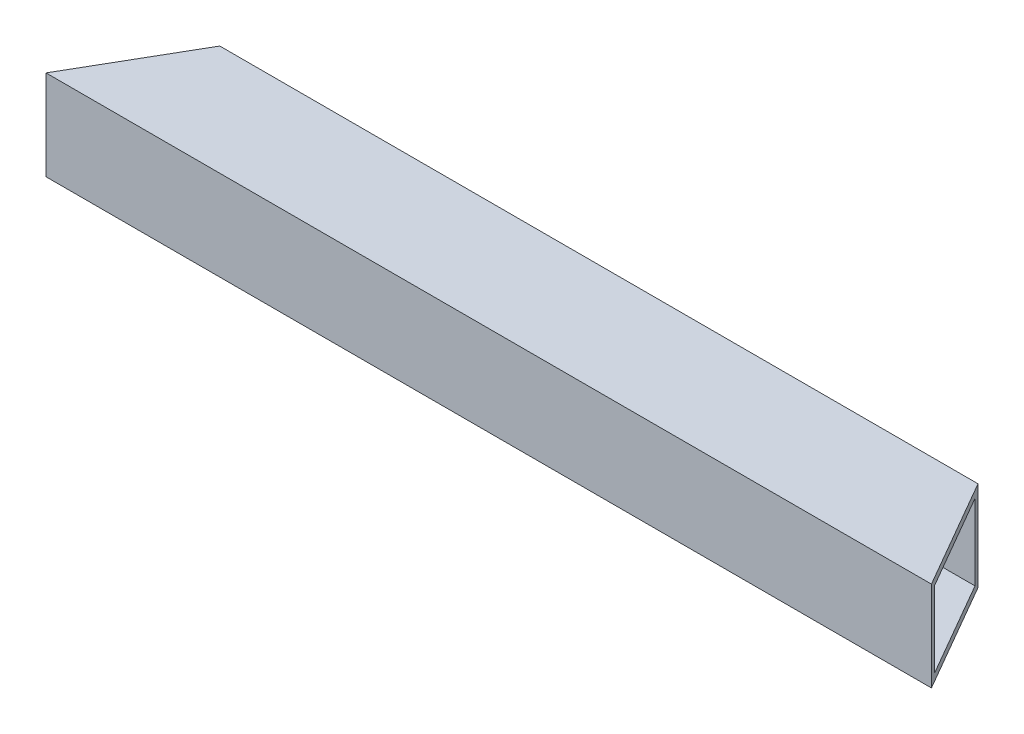
ISO-10303-21;
HEADER;
FILE_DESCRIPTION(('STEP AP214'),'2;1');
FILE_NAME('part.step','',(''),(''),'','','');
FILE_SCHEMA(('AUTOMOTIVE_DESIGN { 1 0 10303 214 1 1 1 1 }'));
ENDSEC;
DATA;
#1=APPLICATION_CONTEXT('core data for automotive mechanical design processes');
#2=APPLICATION_PROTOCOL_DEFINITION('international standard','automotive_design',2000,#1);
#3=PRODUCT_CONTEXT('',#1,'mechanical');
#4=PRODUCT('Part','Part','',(#3));
#5=PRODUCT_RELATED_PRODUCT_CATEGORY('part','',(#4));
#6=PRODUCT_DEFINITION_FORMATION('','',#4);
#7=PRODUCT_DEFINITION_CONTEXT('part definition',#1,'design');
#8=PRODUCT_DEFINITION('design','',#6,#7);
#9=PRODUCT_DEFINITION_SHAPE('','',#8);
#10=(LENGTH_UNIT() NAMED_UNIT(*) SI_UNIT(.MILLI.,.METRE.));
#11=(NAMED_UNIT(*) PLANE_ANGLE_UNIT() SI_UNIT($,.RADIAN.));
#12=(NAMED_UNIT(*) SI_UNIT($,.STERADIAN.) SOLID_ANGLE_UNIT());
#13=UNCERTAINTY_MEASURE_WITH_UNIT(LENGTH_MEASURE(1.E-05),#10,'distance_accuracy_value','');
#14=(GEOMETRIC_REPRESENTATION_CONTEXT(3) GLOBAL_UNCERTAINTY_ASSIGNED_CONTEXT((#13)) GLOBAL_UNIT_ASSIGNED_CONTEXT((#10,
#11,#12)) REPRESENTATION_CONTEXT('',''));
#15=CARTESIAN_POINT('',(0.,0.,0.));
#16=DIRECTION('',(0.,0.,1.));
#17=DIRECTION('',(1.,0.,0.));
#18=AXIS2_PLACEMENT_3D('',#15,#16,#17);
#19=CARTESIAN_POINT('',(159.443936722429,25.4,9.20806790460433));
#20=DIRECTION('',(-0.866025403784436,0.,0.500000000000004));
#21=DIRECTION('',(0.500000000000004,0.,0.866025403784436));
#22=AXIS2_PLACEMENT_3D('',#19,#20,#21);
#23=PLANE('',#22);
#24=DIRECTION('',(-0.500000000000004,0.,-0.866025403784436));
#25=VECTOR('',#24,1.);
#26=CARTESIAN_POINT('',(159.443936722429,0.,9.20806790460433));
#27=LINE('',#26,#25);
#28=CARTESIAN_POINT('',(159.443936722429,0.,9.20806790460433));
#29=VERTEX_POINT('',#28);
#30=CARTESIAN_POINT('',(141.483424480291,0.,-21.9004518287422));
#31=VERTEX_POINT('',#30);
#32=EDGE_CURVE('E158',#29,#31,#27,.T.);
#33=ORIENTED_EDGE('',*,*,#32,.T.);
#34=DIRECTION('',(0.,-1.,0.));
#35=VECTOR('',#34,1.);
#36=CARTESIAN_POINT('',(141.483424480291,25.4,-21.9004518287422));
#37=LINE('',#36,#35);
#38=CARTESIAN_POINT('',(141.483424480291,25.4,-21.9004518287422));
#39=VERTEX_POINT('',#38);
#40=EDGE_CURVE('E43',#39,#31,#37,.T.);
#41=ORIENTED_EDGE('',*,*,#40,.F.);
#42=DIRECTION('',(-0.500000000000004,0.,-0.866025403784436));
#43=VECTOR('',#42,1.);
#44=CARTESIAN_POINT('',(159.443936722429,25.4,9.20806790460433));
#45=LINE('',#44,#43);
#46=CARTESIAN_POINT('',(159.443936722429,25.4,9.20806790460433));
#47=VERTEX_POINT('',#46);
#48=EDGE_CURVE('E87',#47,#39,#45,.T.);
#49=ORIENTED_EDGE('',*,*,#48,.F.);
#50=DIRECTION('',(0.,-1.,0.));
#51=VECTOR('',#50,1.);
#52=CARTESIAN_POINT('',(159.443936722429,25.4,9.20806790460433));
#53=LINE('',#52,#51);
#54=EDGE_CURVE('E11',#47,#29,#53,.T.);
#55=ORIENTED_EDGE('',*,*,#54,.T.);
#56=EDGE_LOOP('',(#33,#41,#49,#55));
#57=FACE_BOUND('',#56,.T.);
#58=DIRECTION('',(-0.500000000000004,0.,-0.866025403784436));
#59=VECTOR('',#58,1.);
#60=CARTESIAN_POINT('',(159.443936722429,2.,9.20806790460433));
#61=LINE('',#60,#59);
#62=CARTESIAN_POINT('',(158.28923618405,2.,7.20806790460433));
#63=VERTEX_POINT('',#62);
#64=CARTESIAN_POINT('',(142.63812501867,2.,-19.9004518287422));
#65=VERTEX_POINT('',#64);
#66=EDGE_CURVE('E131',#63,#65,#61,.T.);
#67=ORIENTED_EDGE('',*,*,#66,.F.);
#68=DIRECTION('',(0.,-1.,0.));
#69=VECTOR('',#68,1.);
#70=CARTESIAN_POINT('',(158.28923618405,25.4,7.20806790460433));
#71=LINE('',#70,#69);
#72=CARTESIAN_POINT('',(158.28923618405,23.4,7.20806790460433));
#73=VERTEX_POINT('',#72);
#74=EDGE_CURVE('E130',#73,#63,#71,.T.);
#75=ORIENTED_EDGE('',*,*,#74,.F.);
#76=DIRECTION('',(-0.500000000000004,0.,-0.866025403784436));
#77=VECTOR('',#76,1.);
#78=CARTESIAN_POINT('',(159.443936722429,23.4,9.20806790460433));
#79=LINE('',#78,#77);
#80=CARTESIAN_POINT('',(142.63812501867,23.4,-19.9004518287422));
#81=VERTEX_POINT('',#80);
#82=EDGE_CURVE('E135',#73,#81,#79,.T.);
#83=ORIENTED_EDGE('',*,*,#82,.T.);
#84=DIRECTION('',(0.,-1.,0.));
#85=VECTOR('',#84,1.);
#86=CARTESIAN_POINT('',(142.63812501867,25.4,-19.9004518287422));
#87=LINE('',#86,#85);
#88=EDGE_CURVE('E140',#81,#65,#87,.T.);
#89=ORIENTED_EDGE('',*,*,#88,.T.);
#90=EDGE_LOOP('',(#67,#75,#83,#89));
#91=FACE_BOUND('',#90,.T.);
#92=ADVANCED_FACE('F35',(#57,#91),#23,.F.);
#93=CARTESIAN_POINT('',(-90.5560632775707,25.4,9.20806790460433));
#94=DIRECTION('',(0.,0.,-1.));
#95=DIRECTION('',(-1.,0.,0.));
#96=AXIS2_PLACEMENT_3D('',#93,#94,#95);
#97=PLANE('',#96);
#98=DIRECTION('',(1.,0.,0.));
#99=VECTOR('',#98,1.);
#100=CARTESIAN_POINT('',(-90.5560632775707,0.,9.20806790460433));
#101=LINE('',#100,#99);
#102=CARTESIAN_POINT('',(-90.5560632775707,0.,9.20806790460433));
#103=VERTEX_POINT('',#102);
#104=EDGE_CURVE('E143',#103,#29,#101,.T.);
#105=ORIENTED_EDGE('',*,*,#104,.T.);
#106=ORIENTED_EDGE('',*,*,#54,.F.);
#107=DIRECTION('',(1.,0.,0.));
#108=VECTOR('',#107,1.);
#109=CARTESIAN_POINT('',(-90.5560632775707,25.4,9.20806790460433));
#110=LINE('',#109,#108);
#111=CARTESIAN_POINT('',(-90.5560632775707,25.4,9.20806790460433));
#112=VERTEX_POINT('',#111);
#113=EDGE_CURVE('E149',#112,#47,#110,.T.);
#114=ORIENTED_EDGE('',*,*,#113,.F.);
#115=DIRECTION('',(0.,-1.,0.));
#116=VECTOR('',#115,1.);
#117=CARTESIAN_POINT('',(-90.5560632775707,25.4,9.20806790460433));
#118=LINE('',#117,#116);
#119=EDGE_CURVE('E155',#112,#103,#118,.T.);
#120=ORIENTED_EDGE('',*,*,#119,.T.);
#121=EDGE_LOOP('',(#105,#106,#114,#120));
#122=FACE_BOUND('',#121,.T.);
#123=ADVANCED_FACE('F37',(#122),#97,.F.);
#124=CARTESIAN_POINT('',(-72.5955510354325,25.4,-21.9004518287422));
#125=DIRECTION('',(0.,0.,1.));
#126=DIRECTION('',(1.,0.,0.));
#127=AXIS2_PLACEMENT_3D('',#124,#125,#126);
#128=PLANE('',#127);
#129=DIRECTION('',(-1.,0.,0.));
#130=VECTOR('',#129,1.);
#131=CARTESIAN_POINT('',(-72.5955510354325,0.,-21.9004518287422));
#132=LINE('',#131,#130);
#133=CARTESIAN_POINT('',(-72.5955510354325,0.,-21.9004518287422));
#134=VERTEX_POINT('',#133);
#135=EDGE_CURVE('E160',#31,#134,#132,.T.);
#136=ORIENTED_EDGE('',*,*,#135,.T.);
#137=DIRECTION('',(0.,-1.,0.));
#138=VECTOR('',#137,1.);
#139=CARTESIAN_POINT('',(-72.5955510354325,25.4,-21.9004518287422));
#140=LINE('',#139,#138);
#141=CARTESIAN_POINT('',(-72.5955510354325,25.4,-21.9004518287422));
#142=VERTEX_POINT('',#141);
#143=EDGE_CURVE('E164',#142,#134,#140,.T.);
#144=ORIENTED_EDGE('',*,*,#143,.F.);
#145=DIRECTION('',(-1.,0.,0.));
#146=VECTOR('',#145,1.);
#147=CARTESIAN_POINT('',(-72.5955510354325,25.4,-21.9004518287422));
#148=LINE('',#147,#146);
#149=EDGE_CURVE('E152',#39,#142,#148,.T.);
#150=ORIENTED_EDGE('',*,*,#149,.F.);
#151=ORIENTED_EDGE('',*,*,#40,.T.);
#152=EDGE_LOOP('',(#136,#144,#150,#151));
#153=FACE_BOUND('',#152,.T.);
#154=ADVANCED_FACE('F169',(#153),#128,.F.);
#155=CARTESIAN_POINT('',(-90.5560632775707,25.4,9.20806790460433));
#156=DIRECTION('',(0.86602540378444,0.,0.499999999999998));
#157=DIRECTION('',(0.499999999999998,0.,-0.86602540378444));
#158=AXIS2_PLACEMENT_3D('',#155,#156,#157);
#159=PLANE('',#158);
#160=DIRECTION('',(-0.499999999999998,0.,0.86602540378444));
#161=VECTOR('',#160,1.);
#162=CARTESIAN_POINT('',(-90.5560632775707,0.,9.20806790460433));
#163=LINE('',#162,#161);
#164=EDGE_CURVE('E80',#134,#103,#163,.T.);
#165=ORIENTED_EDGE('',*,*,#164,.T.);
#166=ORIENTED_EDGE('',*,*,#119,.F.);
#167=DIRECTION('',(-0.499999999999998,0.,0.86602540378444));
#168=VECTOR('',#167,1.);
#169=CARTESIAN_POINT('',(-90.5560632775707,25.4,9.20806790460433));
#170=LINE('',#169,#168);
#171=EDGE_CURVE('E59',#142,#112,#170,.T.);
#172=ORIENTED_EDGE('',*,*,#171,.F.);
#173=ORIENTED_EDGE('',*,*,#143,.T.);
#174=EDGE_LOOP('',(#165,#166,#172,#173));
#175=FACE_BOUND('',#174,.T.);
#176=ADVANCED_FACE('F177',(#175),#159,.F.);
#177=CARTESIAN_POINT('',(0.,25.4,0.));
#178=DIRECTION('',(0.,1.,0.));
#179=DIRECTION('',(0.,0.,1.));
#180=AXIS2_PLACEMENT_3D('',#177,#178,#179);
#181=PLANE('',#180);
#182=ORIENTED_EDGE('',*,*,#113,.T.);
#183=ORIENTED_EDGE('',*,*,#48,.T.);
#184=ORIENTED_EDGE('',*,*,#149,.T.);
#185=ORIENTED_EDGE('',*,*,#171,.T.);
#186=EDGE_LOOP('',(#182,#183,#184,#185));
#187=FACE_BOUND('',#186,.T.);
#188=ADVANCED_FACE('F179',(#187),#181,.T.);
#189=CARTESIAN_POINT('',(0.,0.,0.));
#190=DIRECTION('',(0.,1.,0.));
#191=DIRECTION('',(0.,0.,1.));
#192=AXIS2_PLACEMENT_3D('',#189,#190,#191);
#193=PLANE('',#192);
#194=ORIENTED_EDGE('',*,*,#104,.F.);
#195=ORIENTED_EDGE('',*,*,#164,.F.);
#196=ORIENTED_EDGE('',*,*,#135,.F.);
#197=ORIENTED_EDGE('',*,*,#32,.F.);
#198=EDGE_LOOP('',(#194,#195,#196,#197));
#199=FACE_BOUND('',#198,.T.);
#200=ADVANCED_FACE('F173',(#199),#193,.F.);
#201=CARTESIAN_POINT('',(-90.5560632775707,25.4,7.20806790460433));
#202=DIRECTION('',(0.,0.,-1.));
#203=DIRECTION('',(-1.,0.,0.));
#204=AXIS2_PLACEMENT_3D('',#201,#202,#203);
#205=PLANE('',#204);
#206=DIRECTION('',(1.,0.,0.));
#207=VECTOR('',#206,1.);
#208=CARTESIAN_POINT('',(-90.5560632775707,2.,7.20806790460433));
#209=LINE('',#208,#207);
#210=CARTESIAN_POINT('',(-87.091961662433,2.,7.20806790460433));
#211=VERTEX_POINT('',#210);
#212=EDGE_CURVE('E114',#211,#63,#209,.T.);
#213=ORIENTED_EDGE('',*,*,#212,.F.);
#214=DIRECTION('',(0.,-1.,0.));
#215=VECTOR('',#214,1.);
#216=CARTESIAN_POINT('',(-87.091961662433,25.4,7.20806790460433));
#217=LINE('',#216,#215);
#218=CARTESIAN_POINT('',(-87.091961662433,23.4,7.20806790460433));
#219=VERTEX_POINT('',#218);
#220=EDGE_CURVE('E122',#219,#211,#217,.T.);
#221=ORIENTED_EDGE('',*,*,#220,.F.);
#222=DIRECTION('',(1.,0.,0.));
#223=VECTOR('',#222,1.);
#224=CARTESIAN_POINT('',(-90.5560632775707,23.4,7.20806790460433));
#225=LINE('',#224,#223);
#226=EDGE_CURVE('E50',#219,#73,#225,.T.);
#227=ORIENTED_EDGE('',*,*,#226,.T.);
#228=ORIENTED_EDGE('',*,*,#74,.T.);
#229=EDGE_LOOP('',(#213,#221,#227,#228));
#230=FACE_BOUND('',#229,.T.);
#231=ADVANCED_FACE('F128',(#230),#205,.T.);
#232=CARTESIAN_POINT('',(-72.5955510354325,25.4,-19.9004518287422));
#233=DIRECTION('',(0.,0.,1.));
#234=DIRECTION('',(1.,0.,0.));
#235=AXIS2_PLACEMENT_3D('',#232,#233,#234);
#236=PLANE('',#235);
#237=DIRECTION('',(-1.,0.,0.));
#238=VECTOR('',#237,1.);
#239=CARTESIAN_POINT('',(-72.5955510354325,2.,-19.9004518287422));
#240=LINE('',#239,#238);
#241=CARTESIAN_POINT('',(-71.4408504970532,2.,-19.9004518287422));
#242=VERTEX_POINT('',#241);
#243=EDGE_CURVE('E117',#65,#242,#240,.T.);
#244=ORIENTED_EDGE('',*,*,#243,.F.);
#245=ORIENTED_EDGE('',*,*,#88,.F.);
#246=DIRECTION('',(-1.,0.,0.));
#247=VECTOR('',#246,1.);
#248=CARTESIAN_POINT('',(-72.5955510354325,23.4,-19.9004518287422));
#249=LINE('',#248,#247);
#250=CARTESIAN_POINT('',(-71.4408504970532,23.4,-19.9004518287422));
#251=VERTEX_POINT('',#250);
#252=EDGE_CURVE('E138',#81,#251,#249,.T.);
#253=ORIENTED_EDGE('',*,*,#252,.T.);
#254=DIRECTION('',(0.,-1.,0.));
#255=VECTOR('',#254,1.);
#256=CARTESIAN_POINT('',(-71.4408504970532,25.4,-19.9004518287422));
#257=LINE('',#256,#255);
#258=EDGE_CURVE('E126',#251,#242,#257,.T.);
#259=ORIENTED_EDGE('',*,*,#258,.T.);
#260=EDGE_LOOP('',(#244,#245,#253,#259));
#261=FACE_BOUND('',#260,.T.);
#262=ADVANCED_FACE('F194',(#261),#236,.T.);
#263=CARTESIAN_POINT('',(-88.8240124700018,25.4,10.2080679046043));
#264=DIRECTION('',(0.86602540378444,0.,0.499999999999998));
#265=DIRECTION('',(0.499999999999998,0.,-0.86602540378444));
#266=AXIS2_PLACEMENT_3D('',#263,#264,#265);
#267=PLANE('',#266);
#268=DIRECTION('',(-0.499999999999998,0.,0.86602540378444));
#269=VECTOR('',#268,1.);
#270=CARTESIAN_POINT('',(-88.8240124700018,2.,10.2080679046043));
#271=LINE('',#270,#269);
#272=EDGE_CURVE('E110',#242,#211,#271,.T.);
#273=ORIENTED_EDGE('',*,*,#272,.F.);
#274=ORIENTED_EDGE('',*,*,#258,.F.);
#275=DIRECTION('',(-0.499999999999998,0.,0.86602540378444));
#276=VECTOR('',#275,1.);
#277=CARTESIAN_POINT('',(-88.8240124700018,23.4,10.2080679046043));
#278=LINE('',#277,#276);
#279=EDGE_CURVE('E125',#251,#219,#278,.T.);
#280=ORIENTED_EDGE('',*,*,#279,.T.);
#281=ORIENTED_EDGE('',*,*,#220,.T.);
#282=EDGE_LOOP('',(#273,#274,#280,#281));
#283=FACE_BOUND('',#282,.T.);
#284=ADVANCED_FACE('F123',(#283),#267,.T.);
#285=CARTESIAN_POINT('',(0.,23.4,0.));
#286=DIRECTION('',(0.,1.,0.));
#287=DIRECTION('',(0.,0.,1.));
#288=AXIS2_PLACEMENT_3D('',#285,#286,#287);
#289=PLANE('',#288);
#290=ORIENTED_EDGE('',*,*,#226,.F.);
#291=ORIENTED_EDGE('',*,*,#279,.F.);
#292=ORIENTED_EDGE('',*,*,#252,.F.);
#293=ORIENTED_EDGE('',*,*,#82,.F.);
#294=EDGE_LOOP('',(#290,#291,#292,#293));
#295=FACE_BOUND('',#294,.T.);
#296=ADVANCED_FACE('F197',(#295),#289,.F.);
#297=CARTESIAN_POINT('',(0.,2.,0.));
#298=DIRECTION('',(0.,1.,0.));
#299=DIRECTION('',(0.,0.,1.));
#300=AXIS2_PLACEMENT_3D('',#297,#298,#299);
#301=PLANE('',#300);
#302=ORIENTED_EDGE('',*,*,#212,.T.);
#303=ORIENTED_EDGE('',*,*,#66,.T.);
#304=ORIENTED_EDGE('',*,*,#243,.T.);
#305=ORIENTED_EDGE('',*,*,#272,.T.);
#306=EDGE_LOOP('',(#302,#303,#304,#305));
#307=FACE_BOUND('',#306,.T.);
#308=ADVANCED_FACE('F112',(#307),#301,.T.);
#309=CLOSED_SHELL('',(#92,#123,#154,#176,#188,#200,#231,#262,#284,#296,#308));
#310=MANIFOLD_SOLID_BREP('B2',#309);
#311=ADVANCED_BREP_SHAPE_REPRESENTATION('',(#18,#310),#14);
#312=SHAPE_DEFINITION_REPRESENTATION(#9,#311);
ENDSEC;
END-ISO-10303-21;
